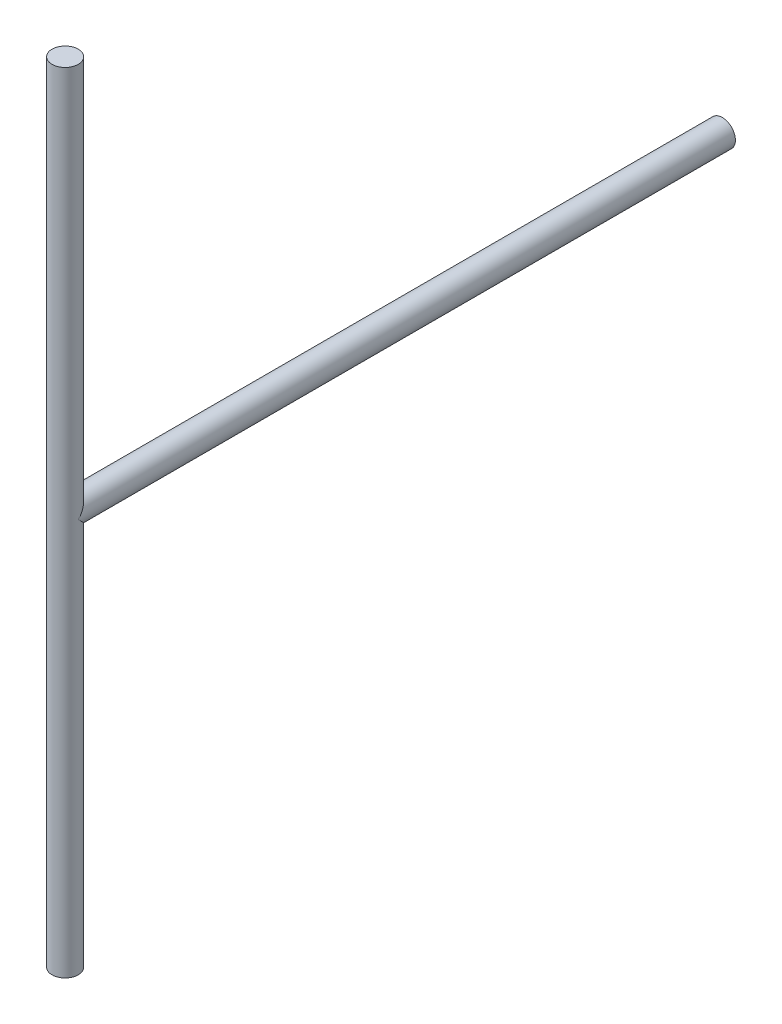
ISO-10303-21;
HEADER;
FILE_DESCRIPTION(('STEP AP214'),'2;1');
FILE_NAME('part.step','',(''),(''),'','','');
FILE_SCHEMA(('AUTOMOTIVE_DESIGN { 1 0 10303 214 1 1 1 1 }'));
ENDSEC;
DATA;
#1=APPLICATION_CONTEXT('core data for automotive mechanical design processes');
#2=APPLICATION_PROTOCOL_DEFINITION('international standard','automotive_design',2000,#1);
#3=PRODUCT_CONTEXT('',#1,'mechanical');
#4=PRODUCT('Part','Part','',(#3));
#5=PRODUCT_RELATED_PRODUCT_CATEGORY('part','',(#4));
#6=PRODUCT_DEFINITION_FORMATION('','',#4);
#7=PRODUCT_DEFINITION_CONTEXT('part definition',#1,'design');
#8=PRODUCT_DEFINITION('design','',#6,#7);
#9=PRODUCT_DEFINITION_SHAPE('','',#8);
#10=(LENGTH_UNIT() NAMED_UNIT(*) SI_UNIT(.MILLI.,.METRE.));
#11=(NAMED_UNIT(*) PLANE_ANGLE_UNIT() SI_UNIT($,.RADIAN.));
#12=(NAMED_UNIT(*) SI_UNIT($,.STERADIAN.) SOLID_ANGLE_UNIT());
#13=UNCERTAINTY_MEASURE_WITH_UNIT(LENGTH_MEASURE(1.E-05),#10,'distance_accuracy_value','');
#14=(GEOMETRIC_REPRESENTATION_CONTEXT(3) GLOBAL_UNCERTAINTY_ASSIGNED_CONTEXT((#13)) GLOBAL_UNIT_ASSIGNED_CONTEXT((#10,
#11,#12)) REPRESENTATION_CONTEXT('',''));
#15=CARTESIAN_POINT('',(0.,0.,0.));
#16=DIRECTION('',(0.,0.,1.));
#17=DIRECTION('',(1.,0.,0.));
#18=AXIS2_PLACEMENT_3D('',#15,#16,#17);
#19=CARTESIAN_POINT('',(0.,0.,-50.));
#20=DIRECTION('',(0.,0.,1.));
#21=DIRECTION('',(1.,0.,0.));
#22=AXIS2_PLACEMENT_3D('',#19,#20,#21);
#23=CYLINDRICAL_SURFACE('',#22,1.);
#24=CARTESIAN_POINT('',(0.,0.,0.));
#25=DIRECTION('',(0.,0.707106781186547,0.707106781186547));
#26=DIRECTION('',(0.,-0.707106781186547,0.707106781186547));
#27=AXIS2_PLACEMENT_3D('',#24,#25,#26);
#28=ELLIPSE('',#27,1.4142135623731,1.);
#29=CARTESIAN_POINT('',(1.,0.,0.));
#30=VERTEX_POINT('',#29);
#31=CARTESIAN_POINT('',(-1.,0.,0.));
#32=VERTEX_POINT('',#31);
#33=EDGE_CURVE('E40',#30,#32,#28,.T.);
#34=ORIENTED_EDGE('',*,*,#33,.F.);
#35=CARTESIAN_POINT('',(0.,0.,0.));
#36=DIRECTION('',(0.,-0.707106781186547,0.707106781186547));
#37=DIRECTION('',(0.,0.707106781186547,0.707106781186547));
#38=AXIS2_PLACEMENT_3D('',#35,#36,#37);
#39=ELLIPSE('',#38,1.4142135623731,1.);
#40=EDGE_CURVE('E46',#32,#30,#39,.T.);
#41=ORIENTED_EDGE('',*,*,#40,.F.);
#42=EDGE_LOOP('',(#34,#41));
#43=FACE_BOUND('',#42,.T.);
#44=CARTESIAN_POINT('',(0.,0.,-50.));
#45=DIRECTION('',(0.,0.,1.));
#46=DIRECTION('',(1.,0.,0.));
#47=AXIS2_PLACEMENT_3D('',#44,#45,#46);
#48=CIRCLE('',#47,1.);
#49=CARTESIAN_POINT('',(1.,0.,-50.));
#50=VERTEX_POINT('',#49);
#51=EDGE_CURVE('E11',#50,#50,#48,.T.);
#52=ORIENTED_EDGE('',*,*,#51,.T.);
#53=EDGE_LOOP('',(#52));
#54=FACE_BOUND('',#53,.T.);
#55=ADVANCED_FACE('F33',(#43,#54),#23,.T.);
#56=CARTESIAN_POINT('',(0.,0.,-50.));
#57=DIRECTION('',(0.,0.,1.));
#58=DIRECTION('',(1.,0.,0.));
#59=AXIS2_PLACEMENT_3D('',#56,#57,#58);
#60=PLANE('',#59);
#61=ORIENTED_EDGE('',*,*,#51,.F.);
#62=EDGE_LOOP('',(#61));
#63=FACE_BOUND('',#62,.T.);
#64=ADVANCED_FACE('F65',(#63),#60,.F.);
#65=CARTESIAN_POINT('',(0.,-30.,0.));
#66=DIRECTION('',(0.,1.,0.));
#67=DIRECTION('',(0.,0.,1.));
#68=AXIS2_PLACEMENT_3D('',#65,#66,#67);
#69=CYLINDRICAL_SURFACE('',#68,1.);
#70=ORIENTED_EDGE('',*,*,#40,.T.);
#71=ORIENTED_EDGE('',*,*,#33,.T.);
#72=EDGE_LOOP('',(#70,#71));
#73=FACE_BOUND('',#72,.T.);
#74=CARTESIAN_POINT('',(0.,-30.,0.));
#75=DIRECTION('',(0.,1.,0.));
#76=DIRECTION('',(0.,0.,1.));
#77=AXIS2_PLACEMENT_3D('',#74,#75,#76);
#78=CIRCLE('',#77,1.);
#79=CARTESIAN_POINT('',(0.,-30.,1.));
#80=VERTEX_POINT('',#79);
#81=EDGE_CURVE('E52',#80,#80,#78,.T.);
#82=ORIENTED_EDGE('',*,*,#81,.T.);
#83=EDGE_LOOP('',(#82));
#84=FACE_BOUND('',#83,.T.);
#85=CARTESIAN_POINT('',(0.,30.,0.));
#86=DIRECTION('',(0.,1.,0.));
#87=DIRECTION('',(0.,0.,1.));
#88=AXIS2_PLACEMENT_3D('',#85,#86,#87);
#89=CIRCLE('',#88,1.);
#90=CARTESIAN_POINT('',(0.,30.,1.));
#91=VERTEX_POINT('',#90);
#92=EDGE_CURVE('E55',#91,#91,#89,.T.);
#93=ORIENTED_EDGE('',*,*,#92,.F.);
#94=EDGE_LOOP('',(#93));
#95=FACE_BOUND('',#94,.T.);
#96=ADVANCED_FACE('F50',(#73,#84,#95),#69,.T.);
#97=CARTESIAN_POINT('',(0.,-30.,0.));
#98=DIRECTION('',(0.,1.,0.));
#99=DIRECTION('',(0.,0.,1.));
#100=AXIS2_PLACEMENT_3D('',#97,#98,#99);
#101=PLANE('',#100);
#102=ORIENTED_EDGE('',*,*,#81,.F.);
#103=EDGE_LOOP('',(#102));
#104=FACE_BOUND('',#103,.T.);
#105=ADVANCED_FACE('F64',(#104),#101,.F.);
#106=CARTESIAN_POINT('',(0.,30.,0.));
#107=DIRECTION('',(0.,1.,0.));
#108=DIRECTION('',(0.,0.,1.));
#109=AXIS2_PLACEMENT_3D('',#106,#107,#108);
#110=PLANE('',#109);
#111=ORIENTED_EDGE('',*,*,#92,.T.);
#112=EDGE_LOOP('',(#111));
#113=FACE_BOUND('',#112,.T.);
#114=ADVANCED_FACE('F61',(#113),#110,.T.);
#115=CLOSED_SHELL('',(#55,#64,#96,#105,#114));
#116=MANIFOLD_SOLID_BREP('B2',#115);
#117=ADVANCED_BREP_SHAPE_REPRESENTATION('',(#18,#116),#14);
#118=SHAPE_DEFINITION_REPRESENTATION(#9,#117);
ENDSEC;
END-ISO-10303-21;
